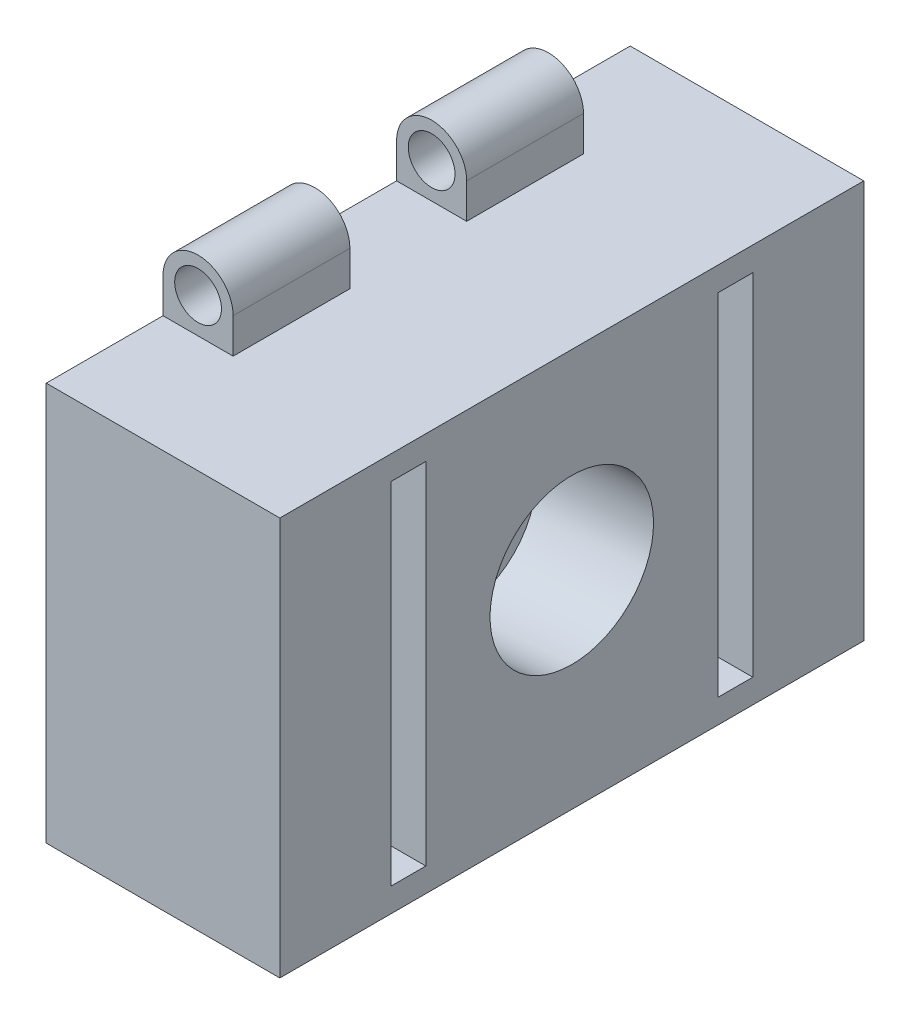
ISO-10303-21;
HEADER;
FILE_DESCRIPTION(('STEP AP214'),'2;1');
FILE_NAME('part.step','',(''),(''),'','','');
FILE_SCHEMA(('AUTOMOTIVE_DESIGN { 1 0 10303 214 1 1 1 1 }'));
ENDSEC;
DATA;
#1=APPLICATION_CONTEXT('core data for automotive mechanical design processes');
#2=APPLICATION_PROTOCOL_DEFINITION('international standard','automotive_design',2000,#1);
#3=PRODUCT_CONTEXT('',#1,'mechanical');
#4=PRODUCT('Part','Part','',(#3));
#5=PRODUCT_RELATED_PRODUCT_CATEGORY('part','',(#4));
#6=PRODUCT_DEFINITION_FORMATION('','',#4);
#7=PRODUCT_DEFINITION_CONTEXT('part definition',#1,'design');
#8=PRODUCT_DEFINITION('design','',#6,#7);
#9=PRODUCT_DEFINITION_SHAPE('','',#8);
#10=(LENGTH_UNIT() NAMED_UNIT(*) SI_UNIT(.MILLI.,.METRE.));
#11=(NAMED_UNIT(*) PLANE_ANGLE_UNIT() SI_UNIT($,.RADIAN.));
#12=(NAMED_UNIT(*) SI_UNIT($,.STERADIAN.) SOLID_ANGLE_UNIT());
#13=UNCERTAINTY_MEASURE_WITH_UNIT(LENGTH_MEASURE(1.E-05),#10,'distance_accuracy_value','');
#14=(GEOMETRIC_REPRESENTATION_CONTEXT(3) GLOBAL_UNCERTAINTY_ASSIGNED_CONTEXT((#13)) GLOBAL_UNIT_ASSIGNED_CONTEXT((#10,
#11,#12)) REPRESENTATION_CONTEXT('',''));
#15=CARTESIAN_POINT('',(0.,0.,0.));
#16=DIRECTION('',(0.,0.,1.));
#17=DIRECTION('',(1.,0.,0.));
#18=AXIS2_PLACEMENT_3D('',#15,#16,#17);
#19=CARTESIAN_POINT('',(20.,0.,0.));
#20=DIRECTION('',(-1.,0.,0.));
#21=DIRECTION('',(0.,0.,1.));
#22=AXIS2_PLACEMENT_3D('',#19,#20,#21);
#23=PLANE('',#22);
#24=DIRECTION('',(0.,0.,-1.));
#25=VECTOR('',#24,1.);
#26=CARTESIAN_POINT('',(20.,2.055,0.));
#27=LINE('',#26,#25);
#28=CARTESIAN_POINT('',(20.,2.055,-9.5));
#29=VERTEX_POINT('',#28);
#30=CARTESIAN_POINT('',(20.,2.055,-12.5));
#31=VERTEX_POINT('',#30);
#32=EDGE_CURVE('E267',#29,#31,#27,.T.);
#33=ORIENTED_EDGE('',*,*,#32,.F.);
#34=DIRECTION('',(0.,-1.,0.));
#35=VECTOR('',#34,1.);
#36=CARTESIAN_POINT('',(20.,0.,-9.5));
#37=LINE('',#36,#35);
#38=CARTESIAN_POINT('',(20.,32.055,-9.5));
#39=VERTEX_POINT('',#38);
#40=EDGE_CURVE('E59',#39,#29,#37,.T.);
#41=ORIENTED_EDGE('',*,*,#40,.F.);
#42=DIRECTION('',(0.,0.,1.));
#43=VECTOR('',#42,1.);
#44=CARTESIAN_POINT('',(20.,32.055,0.));
#45=LINE('',#44,#43);
#46=CARTESIAN_POINT('',(20.,32.055,-12.5));
#47=VERTEX_POINT('',#46);
#48=EDGE_CURVE('E254',#47,#39,#45,.T.);
#49=ORIENTED_EDGE('',*,*,#48,.F.);
#50=DIRECTION('',(0.,1.,0.));
#51=VECTOR('',#50,1.);
#52=CARTESIAN_POINT('',(20.,0.,-12.5));
#53=LINE('',#52,#51);
#54=EDGE_CURVE('E258',#31,#47,#53,.T.);
#55=ORIENTED_EDGE('',*,*,#54,.F.);
#56=EDGE_LOOP('',(#33,#41,#49,#55));
#57=FACE_BOUND('',#56,.T.);
#58=CARTESIAN_POINT('',(20.,17.754268119435,-25.));
#59=DIRECTION('',(-1.,0.,0.));
#60=DIRECTION('',(0.,-1.,0.));
#61=AXIS2_PLACEMENT_3D('',#58,#59,#60);
#62=ELLIPSE('',#61,7.0170932865682,7.);
#63=CARTESIAN_POINT('',(20.,10.7371748328668,-25.));
#64=VERTEX_POINT('',#63);
#65=EDGE_CURVE('E11',#64,#64,#62,.F.);
#66=ORIENTED_EDGE('',*,*,#65,.F.);
#67=EDGE_LOOP('',(#66));
#68=FACE_BOUND('',#67,.T.);
#69=DIRECTION('',(0.,-1.,0.));
#70=VECTOR('',#69,1.);
#71=CARTESIAN_POINT('',(20.,0.,0.));
#72=LINE('',#71,#70);
#73=CARTESIAN_POINT('',(20.,34.11,0.));
#74=VERTEX_POINT('',#73);
#75=CARTESIAN_POINT('',(20.,0.,0.));
#76=VERTEX_POINT('',#75);
#77=EDGE_CURVE('E515',#74,#76,#72,.T.);
#78=ORIENTED_EDGE('',*,*,#77,.T.);
#79=DIRECTION('',(0.,0.,-1.));
#80=VECTOR('',#79,1.);
#81=CARTESIAN_POINT('',(20.,0.,0.));
#82=LINE('',#81,#80);
#83=CARTESIAN_POINT('',(20.,0.,-50.));
#84=VERTEX_POINT('',#83);
#85=EDGE_CURVE('E519',#76,#84,#82,.T.);
#86=ORIENTED_EDGE('',*,*,#85,.T.);
#87=DIRECTION('',(0.,1.,0.));
#88=VECTOR('',#87,1.);
#89=CARTESIAN_POINT('',(20.,0.,-50.));
#90=LINE('',#89,#88);
#91=CARTESIAN_POINT('',(20.,34.11,-50.));
#92=VERTEX_POINT('',#91);
#93=EDGE_CURVE('E523',#84,#92,#90,.T.);
#94=ORIENTED_EDGE('',*,*,#93,.T.);
#95=DIRECTION('',(0.,0.,1.));
#96=VECTOR('',#95,1.);
#97=CARTESIAN_POINT('',(20.,34.11,0.));
#98=LINE('',#97,#96);
#99=EDGE_CURVE('E526',#92,#74,#98,.T.);
#100=ORIENTED_EDGE('',*,*,#99,.T.);
#101=EDGE_LOOP('',(#78,#86,#94,#100));
#102=FACE_BOUND('',#101,.T.);
#103=DIRECTION('',(0.,0.,1.));
#104=VECTOR('',#103,1.);
#105=CARTESIAN_POINT('',(20.,2.055,0.));
#106=LINE('',#105,#104);
#107=CARTESIAN_POINT('',(20.,2.055,-40.5));
#108=VERTEX_POINT('',#107);
#109=CARTESIAN_POINT('',(20.,2.055,-37.5));
#110=VERTEX_POINT('',#109);
#111=EDGE_CURVE('E67',#108,#110,#106,.T.);
#112=ORIENTED_EDGE('',*,*,#111,.T.);
#113=DIRECTION('',(0.,1.,0.));
#114=VECTOR('',#113,1.);
#115=CARTESIAN_POINT('',(20.,0.,-37.5));
#116=LINE('',#115,#114);
#117=CARTESIAN_POINT('',(20.,32.055,-37.5));
#118=VERTEX_POINT('',#117);
#119=EDGE_CURVE('E288',#110,#118,#116,.T.);
#120=ORIENTED_EDGE('',*,*,#119,.T.);
#121=DIRECTION('',(0.,0.,-1.));
#122=VECTOR('',#121,1.);
#123=CARTESIAN_POINT('',(20.,32.055,0.));
#124=LINE('',#123,#122);
#125=CARTESIAN_POINT('',(20.,32.055,-40.5));
#126=VERTEX_POINT('',#125);
#127=EDGE_CURVE('E304',#118,#126,#124,.T.);
#128=ORIENTED_EDGE('',*,*,#127,.T.);
#129=DIRECTION('',(0.,-1.,0.));
#130=VECTOR('',#129,1.);
#131=CARTESIAN_POINT('',(20.,0.,-40.5));
#132=LINE('',#131,#130);
#133=EDGE_CURVE('E300',#126,#108,#132,.T.);
#134=ORIENTED_EDGE('',*,*,#133,.T.);
#135=EDGE_LOOP('',(#112,#120,#128,#134));
#136=FACE_BOUND('',#135,.T.);
#137=ADVANCED_FACE('F43',(#57,#68,#102,#136),#23,.F.);
#138=CARTESIAN_POINT('',(20.,0.,0.));
#139=DIRECTION('',(0.,1.,0.));
#140=DIRECTION('',(0.,0.,1.));
#141=AXIS2_PLACEMENT_3D('',#138,#139,#140);
#142=PLANE('',#141);
#143=DIRECTION('',(1.,0.,0.));
#144=VECTOR('',#143,1.);
#145=CARTESIAN_POINT('',(0.,0.,-40.));
#146=LINE('',#145,#144);
#147=CARTESIAN_POINT('',(0.,0.,-40.));
#148=VERTEX_POINT('',#147);
#149=CARTESIAN_POINT('',(6.,0.,-40.));
#150=VERTEX_POINT('',#149);
#151=EDGE_CURVE('E333',#148,#150,#146,.T.);
#152=ORIENTED_EDGE('',*,*,#151,.F.);
#153=DIRECTION('',(0.,0.,-1.));
#154=VECTOR('',#153,1.);
#155=CARTESIAN_POINT('',(0.,0.,0.));
#156=LINE('',#155,#154);
#157=CARTESIAN_POINT('',(0.,0.,-50.));
#158=VERTEX_POINT('',#157);
#159=EDGE_CURVE('E533',#148,#158,#156,.T.);
#160=ORIENTED_EDGE('',*,*,#159,.T.);
#161=DIRECTION('',(-1.,0.,0.));
#162=VECTOR('',#161,1.);
#163=CARTESIAN_POINT('',(20.,0.,-50.));
#164=LINE('',#163,#162);
#165=EDGE_CURVE('E552',#84,#158,#164,.T.);
#166=ORIENTED_EDGE('',*,*,#165,.F.);
#167=ORIENTED_EDGE('',*,*,#85,.F.);
#168=DIRECTION('',(-1.,0.,0.));
#169=VECTOR('',#168,1.);
#170=CARTESIAN_POINT('',(20.,0.,0.));
#171=LINE('',#170,#169);
#172=CARTESIAN_POINT('',(0.,0.,0.));
#173=VERTEX_POINT('',#172);
#174=EDGE_CURVE('E52',#76,#173,#171,.T.);
#175=ORIENTED_EDGE('',*,*,#174,.T.);
#176=CARTESIAN_POINT('',(0.,0.,-10.));
#177=VERTEX_POINT('',#176);
#178=EDGE_CURVE('E534',#173,#177,#156,.T.);
#179=ORIENTED_EDGE('',*,*,#178,.T.);
#180=DIRECTION('',(1.,0.,0.));
#181=VECTOR('',#180,1.);
#182=CARTESIAN_POINT('',(3.,0.,-10.));
#183=LINE('',#182,#181);
#184=CARTESIAN_POINT('',(6.,0.,-10.));
#185=VERTEX_POINT('',#184);
#186=EDGE_CURVE('E385',#177,#185,#183,.T.);
#187=ORIENTED_EDGE('',*,*,#186,.T.);
#188=DIRECTION('',(0.,0.,1.));
#189=VECTOR('',#188,1.);
#190=CARTESIAN_POINT('',(6.,0.,-20.));
#191=LINE('',#190,#189);
#192=CARTESIAN_POINT('',(6.,0.,-20.));
#193=VERTEX_POINT('',#192);
#194=EDGE_CURVE('E407',#193,#185,#191,.T.);
#195=ORIENTED_EDGE('',*,*,#194,.F.);
#196=DIRECTION('',(1.,0.,0.));
#197=VECTOR('',#196,1.);
#198=CARTESIAN_POINT('',(0.,0.,-20.));
#199=LINE('',#198,#197);
#200=CARTESIAN_POINT('',(0.,0.,-20.));
#201=VERTEX_POINT('',#200);
#202=EDGE_CURVE('E380',#201,#193,#199,.T.);
#203=ORIENTED_EDGE('',*,*,#202,.F.);
#204=CARTESIAN_POINT('',(0.,0.,-30.));
#205=VERTEX_POINT('',#204);
#206=EDGE_CURVE('E538',#201,#205,#156,.T.);
#207=ORIENTED_EDGE('',*,*,#206,.T.);
#208=DIRECTION('',(1.,0.,0.));
#209=VECTOR('',#208,1.);
#210=CARTESIAN_POINT('',(3.,0.,-30.));
#211=LINE('',#210,#209);
#212=CARTESIAN_POINT('',(6.,0.,-30.));
#213=VERTEX_POINT('',#212);
#214=EDGE_CURVE('E338',#205,#213,#211,.T.);
#215=ORIENTED_EDGE('',*,*,#214,.T.);
#216=DIRECTION('',(0.,0.,1.));
#217=VECTOR('',#216,1.);
#218=CARTESIAN_POINT('',(6.,0.,-40.));
#219=LINE('',#218,#217);
#220=EDGE_CURVE('E360',#150,#213,#219,.T.);
#221=ORIENTED_EDGE('',*,*,#220,.F.);
#222=EDGE_LOOP('',(#152,#160,#166,#167,#175,#179,#187,#195,#203,#207,#215,#221));
#223=FACE_BOUND('',#222,.T.);
#224=ADVANCED_FACE('F560',(#223),#142,.F.);
#225=CARTESIAN_POINT('',(20.,34.11,0.));
#226=DIRECTION('',(0.,-1.,0.));
#227=DIRECTION('',(0.,0.,-1.));
#228=AXIS2_PLACEMENT_3D('',#225,#226,#227);
#229=PLANE('',#228);
#230=DIRECTION('',(1.,0.,0.));
#231=VECTOR('',#230,1.);
#232=CARTESIAN_POINT('',(0.,34.11,-40.));
#233=LINE('',#232,#231);
#234=CARTESIAN_POINT('',(0.,34.11,-40.));
#235=VERTEX_POINT('',#234);
#236=CARTESIAN_POINT('',(6.,34.11,-40.));
#237=VERTEX_POINT('',#236);
#238=EDGE_CURVE('E427',#235,#237,#233,.T.);
#239=ORIENTED_EDGE('',*,*,#238,.T.);
#240=DIRECTION('',(0.,0.,1.));
#241=VECTOR('',#240,1.);
#242=CARTESIAN_POINT('',(6.,34.11,-40.));
#243=LINE('',#242,#241);
#244=CARTESIAN_POINT('',(6.,34.11,-30.));
#245=VERTEX_POINT('',#244);
#246=EDGE_CURVE('E443',#237,#245,#243,.T.);
#247=ORIENTED_EDGE('',*,*,#246,.T.);
#248=DIRECTION('',(1.,0.,0.));
#249=VECTOR('',#248,1.);
#250=CARTESIAN_POINT('',(3.,34.11,-30.));
#251=LINE('',#250,#249);
#252=CARTESIAN_POINT('',(0.,34.11,-30.));
#253=VERTEX_POINT('',#252);
#254=EDGE_CURVE('E423',#253,#245,#251,.T.);
#255=ORIENTED_EDGE('',*,*,#254,.F.);
#256=DIRECTION('',(0.,0.,1.));
#257=VECTOR('',#256,1.);
#258=CARTESIAN_POINT('',(0.,34.11,0.));
#259=LINE('',#258,#257);
#260=CARTESIAN_POINT('',(0.,34.11,-20.));
#261=VERTEX_POINT('',#260);
#262=EDGE_CURVE('E544',#253,#261,#259,.T.);
#263=ORIENTED_EDGE('',*,*,#262,.T.);
#264=DIRECTION('',(1.,0.,0.));
#265=VECTOR('',#264,1.);
#266=CARTESIAN_POINT('',(0.,34.11,-20.));
#267=LINE('',#266,#265);
#268=CARTESIAN_POINT('',(6.,34.11,-20.));
#269=VERTEX_POINT('',#268);
#270=EDGE_CURVE('E475',#261,#269,#267,.T.);
#271=ORIENTED_EDGE('',*,*,#270,.T.);
#272=DIRECTION('',(0.,0.,1.));
#273=VECTOR('',#272,1.);
#274=CARTESIAN_POINT('',(6.,34.11,-20.));
#275=LINE('',#274,#273);
#276=CARTESIAN_POINT('',(6.,34.11,-10.));
#277=VERTEX_POINT('',#276);
#278=EDGE_CURVE('E492',#269,#277,#275,.T.);
#279=ORIENTED_EDGE('',*,*,#278,.T.);
#280=DIRECTION('',(1.,0.,0.));
#281=VECTOR('',#280,1.);
#282=CARTESIAN_POINT('',(3.,34.11,-10.));
#283=LINE('',#282,#281);
#284=CARTESIAN_POINT('',(0.,34.11,-10.));
#285=VERTEX_POINT('',#284);
#286=EDGE_CURVE('E471',#285,#277,#283,.T.);
#287=ORIENTED_EDGE('',*,*,#286,.F.);
#288=CARTESIAN_POINT('',(0.,34.11,0.));
#289=VERTEX_POINT('',#288);
#290=EDGE_CURVE('E541',#285,#289,#259,.T.);
#291=ORIENTED_EDGE('',*,*,#290,.T.);
#292=DIRECTION('',(-1.,0.,0.));
#293=VECTOR('',#292,1.);
#294=CARTESIAN_POINT('',(20.,34.11,0.));
#295=LINE('',#294,#293);
#296=EDGE_CURVE('E529',#74,#289,#295,.T.);
#297=ORIENTED_EDGE('',*,*,#296,.F.);
#298=ORIENTED_EDGE('',*,*,#99,.F.);
#299=DIRECTION('',(-1.,0.,0.));
#300=VECTOR('',#299,1.);
#301=CARTESIAN_POINT('',(20.,34.11,-50.));
#302=LINE('',#301,#300);
#303=CARTESIAN_POINT('',(0.,34.11,-50.));
#304=VERTEX_POINT('',#303);
#305=EDGE_CURVE('E548',#92,#304,#302,.T.);
#306=ORIENTED_EDGE('',*,*,#305,.T.);
#307=EDGE_CURVE('E520',#304,#235,#259,.T.);
#308=ORIENTED_EDGE('',*,*,#307,.T.);
#309=EDGE_LOOP('',(#239,#247,#255,#263,#271,#279,#287,#291,#297,#298,#306,#308));
#310=FACE_BOUND('',#309,.T.);
#311=ADVANCED_FACE('F602',(#310),#229,.F.);
#312=CARTESIAN_POINT('',(20.,0.,0.));
#313=DIRECTION('',(0.,0.,-1.));
#314=DIRECTION('',(-1.,0.,0.));
#315=AXIS2_PLACEMENT_3D('',#312,#313,#314);
#316=PLANE('',#315);
#317=DIRECTION('',(0.,-1.,0.));
#318=VECTOR('',#317,1.);
#319=CARTESIAN_POINT('',(0.,0.,0.));
#320=LINE('',#319,#318);
#321=EDGE_CURVE('E508',#289,#173,#320,.T.);
#322=ORIENTED_EDGE('',*,*,#321,.T.);
#323=ORIENTED_EDGE('',*,*,#174,.F.);
#324=ORIENTED_EDGE('',*,*,#77,.F.);
#325=ORIENTED_EDGE('',*,*,#296,.T.);
#326=EDGE_LOOP('',(#322,#323,#324,#325));
#327=FACE_BOUND('',#326,.T.);
#328=ADVANCED_FACE('F45',(#327),#316,.F.);
#329=CARTESIAN_POINT('',(20.,0.,-50.));
#330=DIRECTION('',(0.,0.,1.));
#331=DIRECTION('',(1.,0.,0.));
#332=AXIS2_PLACEMENT_3D('',#329,#330,#331);
#333=PLANE('',#332);
#334=DIRECTION('',(0.,1.,0.));
#335=VECTOR('',#334,1.);
#336=CARTESIAN_POINT('',(0.,0.,-50.));
#337=LINE('',#336,#335);
#338=EDGE_CURVE('E537',#158,#304,#337,.T.);
#339=ORIENTED_EDGE('',*,*,#338,.T.);
#340=ORIENTED_EDGE('',*,*,#305,.F.);
#341=ORIENTED_EDGE('',*,*,#93,.F.);
#342=ORIENTED_EDGE('',*,*,#165,.T.);
#343=EDGE_LOOP('',(#339,#340,#341,#342));
#344=FACE_BOUND('',#343,.T.);
#345=ADVANCED_FACE('F596',(#344),#333,.F.);
#346=CARTESIAN_POINT('',(0.,0.,0.));
#347=DIRECTION('',(-1.,0.,0.));
#348=DIRECTION('',(0.,0.,1.));
#349=AXIS2_PLACEMENT_3D('',#346,#347,#348);
#350=PLANE('',#349);
#351=ORIENTED_EDGE('',*,*,#321,.F.);
#352=ORIENTED_EDGE('',*,*,#290,.F.);
#353=DIRECTION('',(0.,-1.,0.));
#354=VECTOR('',#353,1.);
#355=CARTESIAN_POINT('',(0.,34.11,-10.));
#356=LINE('',#355,#354);
#357=CARTESIAN_POINT('',(0.,37.11,-10.));
#358=VERTEX_POINT('',#357);
#359=EDGE_CURVE('E480',#358,#285,#356,.T.);
#360=ORIENTED_EDGE('',*,*,#359,.F.);
#361=DIRECTION('',(0.,0.,1.));
#362=VECTOR('',#361,1.);
#363=CARTESIAN_POINT('',(0.,37.11,-20.));
#364=LINE('',#363,#362);
#365=CARTESIAN_POINT('',(0.,37.11,-20.));
#366=VERTEX_POINT('',#365);
#367=EDGE_CURVE('E505',#366,#358,#364,.T.);
#368=ORIENTED_EDGE('',*,*,#367,.F.);
#369=DIRECTION('',(0.,-1.,0.));
#370=VECTOR('',#369,1.);
#371=CARTESIAN_POINT('',(0.,34.11,-20.));
#372=LINE('',#371,#370);
#373=EDGE_CURVE('E488',#366,#261,#372,.T.);
#374=ORIENTED_EDGE('',*,*,#373,.T.);
#375=ORIENTED_EDGE('',*,*,#262,.F.);
#376=DIRECTION('',(0.,-1.,0.));
#377=VECTOR('',#376,1.);
#378=CARTESIAN_POINT('',(0.,34.11,-30.));
#379=LINE('',#378,#377);
#380=CARTESIAN_POINT('',(0.,37.11,-30.));
#381=VERTEX_POINT('',#380);
#382=EDGE_CURVE('E431',#381,#253,#379,.T.);
#383=ORIENTED_EDGE('',*,*,#382,.F.);
#384=DIRECTION('',(0.,0.,1.));
#385=VECTOR('',#384,1.);
#386=CARTESIAN_POINT('',(0.,37.11,-40.));
#387=LINE('',#386,#385);
#388=CARTESIAN_POINT('',(0.,37.11,-40.));
#389=VERTEX_POINT('',#388);
#390=EDGE_CURVE('E458',#389,#381,#387,.T.);
#391=ORIENTED_EDGE('',*,*,#390,.F.);
#392=DIRECTION('',(0.,-1.,0.));
#393=VECTOR('',#392,1.);
#394=CARTESIAN_POINT('',(0.,34.11,-40.));
#395=LINE('',#394,#393);
#396=EDGE_CURVE('E439',#389,#235,#395,.T.);
#397=ORIENTED_EDGE('',*,*,#396,.T.);
#398=ORIENTED_EDGE('',*,*,#307,.F.);
#399=ORIENTED_EDGE('',*,*,#338,.F.);
#400=ORIENTED_EDGE('',*,*,#159,.F.);
#401=DIRECTION('',(0.,1.,0.));
#402=VECTOR('',#401,1.);
#403=CARTESIAN_POINT('',(0.,0.,-40.));
#404=LINE('',#403,#402);
#405=CARTESIAN_POINT('',(0.,-3.,-40.));
#406=VERTEX_POINT('',#405);
#407=EDGE_CURVE('E337',#406,#148,#404,.T.);
#408=ORIENTED_EDGE('',*,*,#407,.F.);
#409=DIRECTION('',(0.,0.,1.));
#410=VECTOR('',#409,1.);
#411=CARTESIAN_POINT('',(0.,-3.,-40.));
#412=LINE('',#411,#410);
#413=CARTESIAN_POINT('',(0.,-3.,-30.));
#414=VERTEX_POINT('',#413);
#415=EDGE_CURVE('E348',#406,#414,#412,.T.);
#416=ORIENTED_EDGE('',*,*,#415,.T.);
#417=DIRECTION('',(0.,1.,0.));
#418=VECTOR('',#417,1.);
#419=CARTESIAN_POINT('',(0.,0.,-30.));
#420=LINE('',#419,#418);
#421=EDGE_CURVE('E329',#414,#205,#420,.T.);
#422=ORIENTED_EDGE('',*,*,#421,.T.);
#423=ORIENTED_EDGE('',*,*,#206,.F.);
#424=DIRECTION('',(0.,1.,0.));
#425=VECTOR('',#424,1.);
#426=CARTESIAN_POINT('',(0.,0.,-20.));
#427=LINE('',#426,#425);
#428=CARTESIAN_POINT('',(0.,-3.,-20.));
#429=VERTEX_POINT('',#428);
#430=EDGE_CURVE('E384',#429,#201,#427,.T.);
#431=ORIENTED_EDGE('',*,*,#430,.F.);
#432=DIRECTION('',(0.,0.,1.));
#433=VECTOR('',#432,1.);
#434=CARTESIAN_POINT('',(0.,-3.,-20.));
#435=LINE('',#434,#433);
#436=CARTESIAN_POINT('',(0.,-3.,-10.));
#437=VERTEX_POINT('',#436);
#438=EDGE_CURVE('E395',#429,#437,#435,.T.);
#439=ORIENTED_EDGE('',*,*,#438,.T.);
#440=DIRECTION('',(0.,1.,0.));
#441=VECTOR('',#440,1.);
#442=CARTESIAN_POINT('',(0.,0.,-10.));
#443=LINE('',#442,#441);
#444=EDGE_CURVE('E376',#437,#177,#443,.T.);
#445=ORIENTED_EDGE('',*,*,#444,.T.);
#446=ORIENTED_EDGE('',*,*,#178,.F.);
#447=EDGE_LOOP('',(#351,#352,#360,#368,#374,#375,#383,#391,#397,#398,#399,#400,#408,#416,#422,
#423,#431,#439,#445,#446));
#448=FACE_BOUND('',#447,.T.);
#449=ADVANCED_FACE('F569',(#448),#350,.T.);
#450=CARTESIAN_POINT('',(3.,37.11,-20.));
#451=DIRECTION('',(0.,0.,1.));
#452=DIRECTION('',(1.,0.,0.));
#453=AXIS2_PLACEMENT_3D('',#450,#451,#452);
#454=CYLINDRICAL_SURFACE('',#453,3.);
#455=CARTESIAN_POINT('',(3.,37.11,-10.));
#456=DIRECTION('',(0.,0.,1.));
#457=DIRECTION('',(1.,0.,0.));
#458=AXIS2_PLACEMENT_3D('',#455,#456,#457);
#459=CIRCLE('',#458,3.);
#460=CARTESIAN_POINT('',(6.,37.11,-10.));
#461=VERTEX_POINT('',#460);
#462=EDGE_CURVE('E499',#461,#358,#459,.T.);
#463=ORIENTED_EDGE('',*,*,#462,.F.);
#464=DIRECTION('',(0.,0.,1.));
#465=VECTOR('',#464,1.);
#466=CARTESIAN_POINT('',(6.,37.11,-20.));
#467=LINE('',#466,#465);
#468=CARTESIAN_POINT('',(6.,37.11,-20.));
#469=VERTEX_POINT('',#468);
#470=EDGE_CURVE('E509',#469,#461,#467,.T.);
#471=ORIENTED_EDGE('',*,*,#470,.F.);
#472=CARTESIAN_POINT('',(3.,37.11,-20.));
#473=DIRECTION('',(0.,0.,1.));
#474=DIRECTION('',(1.,0.,0.));
#475=AXIS2_PLACEMENT_3D('',#472,#473,#474);
#476=CIRCLE('',#475,3.);
#477=EDGE_CURVE('E484',#469,#366,#476,.T.);
#478=ORIENTED_EDGE('',*,*,#477,.T.);
#479=ORIENTED_EDGE('',*,*,#367,.T.);
#480=EDGE_LOOP('',(#463,#471,#478,#479));
#481=FACE_BOUND('',#480,.T.);
#482=ADVANCED_FACE('F631',(#481),#454,.T.);
#483=CARTESIAN_POINT('',(6.,34.11,-20.));
#484=DIRECTION('',(1.,0.,0.));
#485=DIRECTION('',(0.,0.,-1.));
#486=AXIS2_PLACEMENT_3D('',#483,#484,#485);
#487=PLANE('',#486);
#488=DIRECTION('',(0.,1.,0.));
#489=VECTOR('',#488,1.);
#490=CARTESIAN_POINT('',(6.,34.11,-10.));
#491=LINE('',#490,#489);
#492=EDGE_CURVE('E495',#277,#461,#491,.T.);
#493=ORIENTED_EDGE('',*,*,#492,.F.);
#494=ORIENTED_EDGE('',*,*,#278,.F.);
#495=DIRECTION('',(0.,1.,0.));
#496=VECTOR('',#495,1.);
#497=CARTESIAN_POINT('',(6.,34.11,-20.));
#498=LINE('',#497,#496);
#499=EDGE_CURVE('E479',#269,#469,#498,.T.);
#500=ORIENTED_EDGE('',*,*,#499,.T.);
#501=ORIENTED_EDGE('',*,*,#470,.T.);
#502=EDGE_LOOP('',(#493,#494,#500,#501));
#503=FACE_BOUND('',#502,.T.);
#504=ADVANCED_FACE('F626',(#503),#487,.T.);
#505=CARTESIAN_POINT('',(3.,37.11,-20.));
#506=DIRECTION('',(0.,0.,1.));
#507=DIRECTION('',(1.,0.,0.));
#508=AXIS2_PLACEMENT_3D('',#505,#506,#507);
#509=PLANE('',#508);
#510=CARTESIAN_POINT('',(3.,37.11,-20.));
#511=DIRECTION('',(0.,0.,1.));
#512=DIRECTION('',(1.,0.,0.));
#513=AXIS2_PLACEMENT_3D('',#510,#511,#512);
#514=CIRCLE('',#513,2.);
#515=CARTESIAN_POINT('',(5.,37.11,-20.));
#516=VERTEX_POINT('',#515);
#517=EDGE_CURVE('E467',#516,#516,#514,.T.);
#518=ORIENTED_EDGE('',*,*,#517,.T.);
#519=EDGE_LOOP('',(#518));
#520=FACE_BOUND('',#519,.T.);
#521=ORIENTED_EDGE('',*,*,#270,.F.);
#522=ORIENTED_EDGE('',*,*,#373,.F.);
#523=ORIENTED_EDGE('',*,*,#477,.F.);
#524=ORIENTED_EDGE('',*,*,#499,.F.);
#525=EDGE_LOOP('',(#521,#522,#523,#524));
#526=FACE_BOUND('',#525,.T.);
#527=ADVANCED_FACE('F633',(#520,#526),#509,.F.);
#528=CARTESIAN_POINT('',(3.,37.11,-10.));
#529=DIRECTION('',(0.,0.,1.));
#530=DIRECTION('',(1.,0.,0.));
#531=AXIS2_PLACEMENT_3D('',#528,#529,#530);
#532=PLANE('',#531);
#533=CARTESIAN_POINT('',(3.,37.11,-10.));
#534=DIRECTION('',(0.,0.,1.));
#535=DIRECTION('',(1.,0.,0.));
#536=AXIS2_PLACEMENT_3D('',#533,#534,#535);
#537=CIRCLE('',#536,2.);
#538=CARTESIAN_POINT('',(5.,37.11,-10.));
#539=VERTEX_POINT('',#538);
#540=EDGE_CURVE('E461',#539,#539,#537,.T.);
#541=ORIENTED_EDGE('',*,*,#540,.F.);
#542=EDGE_LOOP('',(#541));
#543=FACE_BOUND('',#542,.T.);
#544=ORIENTED_EDGE('',*,*,#359,.T.);
#545=ORIENTED_EDGE('',*,*,#286,.T.);
#546=ORIENTED_EDGE('',*,*,#492,.T.);
#547=ORIENTED_EDGE('',*,*,#462,.T.);
#548=EDGE_LOOP('',(#544,#545,#546,#547));
#549=FACE_BOUND('',#548,.T.);
#550=ADVANCED_FACE('F624',(#543,#549),#532,.T.);
#551=CARTESIAN_POINT('',(3.,37.11,-20.));
#552=DIRECTION('',(0.,0.,1.));
#553=DIRECTION('',(1.,0.,0.));
#554=AXIS2_PLACEMENT_3D('',#551,#552,#553);
#555=CYLINDRICAL_SURFACE('',#554,2.);
#556=ORIENTED_EDGE('',*,*,#517,.F.);
#557=EDGE_LOOP('',(#556));
#558=FACE_BOUND('',#557,.T.);
#559=ORIENTED_EDGE('',*,*,#540,.T.);
#560=EDGE_LOOP('',(#559));
#561=FACE_BOUND('',#560,.T.);
#562=ADVANCED_FACE('F641',(#558,#561),#555,.F.);
#563=CARTESIAN_POINT('',(3.,37.11,-40.));
#564=DIRECTION('',(0.,0.,1.));
#565=DIRECTION('',(1.,0.,0.));
#566=AXIS2_PLACEMENT_3D('',#563,#564,#565);
#567=CYLINDRICAL_SURFACE('',#566,3.);
#568=CARTESIAN_POINT('',(3.,37.11,-30.));
#569=DIRECTION('',(0.,0.,1.));
#570=DIRECTION('',(1.,0.,0.));
#571=AXIS2_PLACEMENT_3D('',#568,#569,#570);
#572=CIRCLE('',#571,3.);
#573=CARTESIAN_POINT('',(6.,37.11,-30.));
#574=VERTEX_POINT('',#573);
#575=EDGE_CURVE('E451',#574,#381,#572,.T.);
#576=ORIENTED_EDGE('',*,*,#575,.F.);
#577=DIRECTION('',(0.,0.,1.));
#578=VECTOR('',#577,1.);
#579=CARTESIAN_POINT('',(6.,37.11,-40.));
#580=LINE('',#579,#578);
#581=CARTESIAN_POINT('',(6.,37.11,-40.));
#582=VERTEX_POINT('',#581);
#583=EDGE_CURVE('E462',#582,#574,#580,.T.);
#584=ORIENTED_EDGE('',*,*,#583,.F.);
#585=CARTESIAN_POINT('',(3.,37.11,-40.));
#586=DIRECTION('',(0.,0.,1.));
#587=DIRECTION('',(1.,0.,0.));
#588=AXIS2_PLACEMENT_3D('',#585,#586,#587);
#589=CIRCLE('',#588,3.);
#590=EDGE_CURVE('E435',#582,#389,#589,.T.);
#591=ORIENTED_EDGE('',*,*,#590,.T.);
#592=ORIENTED_EDGE('',*,*,#390,.T.);
#593=EDGE_LOOP('',(#576,#584,#591,#592));
#594=FACE_BOUND('',#593,.T.);
#595=ADVANCED_FACE('F711',(#594),#567,.T.);
#596=CARTESIAN_POINT('',(6.,34.11,-40.));
#597=DIRECTION('',(1.,0.,0.));
#598=DIRECTION('',(0.,0.,-1.));
#599=AXIS2_PLACEMENT_3D('',#596,#597,#598);
#600=PLANE('',#599);
#601=DIRECTION('',(0.,1.,0.));
#602=VECTOR('',#601,1.);
#603=CARTESIAN_POINT('',(6.,34.11,-30.));
#604=LINE('',#603,#602);
#605=EDGE_CURVE('E447',#245,#574,#604,.T.);
#606=ORIENTED_EDGE('',*,*,#605,.F.);
#607=ORIENTED_EDGE('',*,*,#246,.F.);
#608=DIRECTION('',(0.,1.,0.));
#609=VECTOR('',#608,1.);
#610=CARTESIAN_POINT('',(6.,34.11,-40.));
#611=LINE('',#610,#609);
#612=EDGE_CURVE('E430',#237,#582,#611,.T.);
#613=ORIENTED_EDGE('',*,*,#612,.T.);
#614=ORIENTED_EDGE('',*,*,#583,.T.);
#615=EDGE_LOOP('',(#606,#607,#613,#614));
#616=FACE_BOUND('',#615,.T.);
#617=ADVANCED_FACE('F611',(#616),#600,.T.);
#618=CARTESIAN_POINT('',(3.,37.11,-40.));
#619=DIRECTION('',(0.,0.,1.));
#620=DIRECTION('',(1.,0.,0.));
#621=AXIS2_PLACEMENT_3D('',#618,#619,#620);
#622=PLANE('',#621);
#623=CARTESIAN_POINT('',(3.,37.11,-40.));
#624=DIRECTION('',(0.,0.,1.));
#625=DIRECTION('',(1.,0.,0.));
#626=AXIS2_PLACEMENT_3D('',#623,#624,#625);
#627=CIRCLE('',#626,2.);
#628=CARTESIAN_POINT('',(5.,37.11,-40.));
#629=VERTEX_POINT('',#628);
#630=EDGE_CURVE('E419',#629,#629,#627,.T.);
#631=ORIENTED_EDGE('',*,*,#630,.T.);
#632=EDGE_LOOP('',(#631));
#633=FACE_BOUND('',#632,.T.);
#634=ORIENTED_EDGE('',*,*,#238,.F.);
#635=ORIENTED_EDGE('',*,*,#396,.F.);
#636=ORIENTED_EDGE('',*,*,#590,.F.);
#637=ORIENTED_EDGE('',*,*,#612,.F.);
#638=EDGE_LOOP('',(#634,#635,#636,#637));
#639=FACE_BOUND('',#638,.T.);
#640=ADVANCED_FACE('F607',(#633,#639),#622,.F.);
#641=CARTESIAN_POINT('',(3.,37.11,-30.));
#642=DIRECTION('',(0.,0.,1.));
#643=DIRECTION('',(1.,0.,0.));
#644=AXIS2_PLACEMENT_3D('',#641,#642,#643);
#645=PLANE('',#644);
#646=CARTESIAN_POINT('',(3.,37.11,-30.));
#647=DIRECTION('',(0.,0.,1.));
#648=DIRECTION('',(1.,0.,0.));
#649=AXIS2_PLACEMENT_3D('',#646,#647,#648);
#650=CIRCLE('',#649,2.);
#651=CARTESIAN_POINT('',(5.,37.11,-30.));
#652=VERTEX_POINT('',#651);
#653=EDGE_CURVE('E411',#652,#652,#650,.T.);
#654=ORIENTED_EDGE('',*,*,#653,.F.);
#655=EDGE_LOOP('',(#654));
#656=FACE_BOUND('',#655,.T.);
#657=ORIENTED_EDGE('',*,*,#382,.T.);
#658=ORIENTED_EDGE('',*,*,#254,.T.);
#659=ORIENTED_EDGE('',*,*,#605,.T.);
#660=ORIENTED_EDGE('',*,*,#575,.T.);
#661=EDGE_LOOP('',(#657,#658,#659,#660));
#662=FACE_BOUND('',#661,.T.);
#663=ADVANCED_FACE('F617',(#656,#662),#645,.T.);
#664=CARTESIAN_POINT('',(3.,37.11,-40.));
#665=DIRECTION('',(0.,0.,1.));
#666=DIRECTION('',(1.,0.,0.));
#667=AXIS2_PLACEMENT_3D('',#664,#665,#666);
#668=CYLINDRICAL_SURFACE('',#667,2.);
#669=ORIENTED_EDGE('',*,*,#630,.F.);
#670=EDGE_LOOP('',(#669));
#671=FACE_BOUND('',#670,.T.);
#672=ORIENTED_EDGE('',*,*,#653,.T.);
#673=EDGE_LOOP('',(#672));
#674=FACE_BOUND('',#673,.T.);
#675=ADVANCED_FACE('F756',(#671,#674),#668,.F.);
#676=CARTESIAN_POINT('',(3.,-3.,-20.));
#677=DIRECTION('',(0.,0.,1.));
#678=DIRECTION('',(1.,0.,0.));
#679=AXIS2_PLACEMENT_3D('',#676,#677,#678);
#680=PLANE('',#679);
#681=ORIENTED_EDGE('',*,*,#202,.T.);
#682=DIRECTION('',(0.,-1.,0.));
#683=VECTOR('',#682,1.);
#684=CARTESIAN_POINT('',(6.,0.,-20.));
#685=LINE('',#684,#683);
#686=CARTESIAN_POINT('',(6.,-3.,-20.));
#687=VERTEX_POINT('',#686);
#688=EDGE_CURVE('E392',#193,#687,#685,.T.);
#689=ORIENTED_EDGE('',*,*,#688,.T.);
#690=CARTESIAN_POINT('',(3.,-3.,-20.));
#691=DIRECTION('',(0.,0.,-1.));
#692=DIRECTION('',(1.,0.,0.));
#693=AXIS2_PLACEMENT_3D('',#690,#691,#692);
#694=CIRCLE('',#693,3.);
#695=EDGE_CURVE('E389',#687,#429,#694,.T.);
#696=ORIENTED_EDGE('',*,*,#695,.T.);
#697=ORIENTED_EDGE('',*,*,#430,.T.);
#698=EDGE_LOOP('',(#681,#689,#696,#697));
#699=FACE_BOUND('',#698,.T.);
#700=CARTESIAN_POINT('',(3.,-3.,-20.));
#701=DIRECTION('',(0.,0.,-1.));
#702=DIRECTION('',(1.,0.,0.));
#703=AXIS2_PLACEMENT_3D('',#700,#701,#702);
#704=CIRCLE('',#703,2.);
#705=CARTESIAN_POINT('',(5.,-3.,-20.));
#706=VERTEX_POINT('',#705);
#707=EDGE_CURVE('E372',#706,#706,#704,.T.);
#708=ORIENTED_EDGE('',*,*,#707,.F.);
#709=EDGE_LOOP('',(#708));
#710=FACE_BOUND('',#709,.T.);
#711=ADVANCED_FACE('F585',(#699,#710),#680,.F.);
#712=CARTESIAN_POINT('',(3.,-3.,-10.));
#713=DIRECTION('',(0.,0.,1.));
#714=DIRECTION('',(1.,0.,0.));
#715=AXIS2_PLACEMENT_3D('',#712,#713,#714);
#716=PLANE('',#715);
#717=ORIENTED_EDGE('',*,*,#186,.F.);
#718=ORIENTED_EDGE('',*,*,#444,.F.);
#719=CARTESIAN_POINT('',(3.,-3.,-10.));
#720=DIRECTION('',(0.,0.,-1.));
#721=DIRECTION('',(1.,0.,0.));
#722=AXIS2_PLACEMENT_3D('',#719,#720,#721);
#723=CIRCLE('',#722,3.);
#724=CARTESIAN_POINT('',(6.,-3.,-10.));
#725=VERTEX_POINT('',#724);
#726=EDGE_CURVE('E399',#725,#437,#723,.T.);
#727=ORIENTED_EDGE('',*,*,#726,.F.);
#728=DIRECTION('',(0.,-1.,0.));
#729=VECTOR('',#728,1.);
#730=CARTESIAN_POINT('',(6.,0.,-10.));
#731=LINE('',#730,#729);
#732=EDGE_CURVE('E402',#185,#725,#731,.T.);
#733=ORIENTED_EDGE('',*,*,#732,.F.);
#734=EDGE_LOOP('',(#717,#718,#727,#733));
#735=FACE_BOUND('',#734,.T.);
#736=CARTESIAN_POINT('',(3.,-3.,-10.));
#737=DIRECTION('',(0.,0.,-1.));
#738=DIRECTION('',(1.,0.,0.));
#739=AXIS2_PLACEMENT_3D('',#736,#737,#738);
#740=CIRCLE('',#739,2.);
#741=CARTESIAN_POINT('',(5.,-3.,-10.));
#742=VERTEX_POINT('',#741);
#743=EDGE_CURVE('E364',#742,#742,#740,.T.);
#744=ORIENTED_EDGE('',*,*,#743,.T.);
#745=EDGE_LOOP('',(#744));
#746=FACE_BOUND('',#745,.T.);
#747=ADVANCED_FACE('F576',(#735,#746),#716,.T.);
#748=CARTESIAN_POINT('',(6.,0.,-20.));
#749=DIRECTION('',(-1.,0.,0.));
#750=DIRECTION('',(0.,0.,1.));
#751=AXIS2_PLACEMENT_3D('',#748,#749,#750);
#752=PLANE('',#751);
#753=ORIENTED_EDGE('',*,*,#732,.T.);
#754=DIRECTION('',(0.,0.,1.));
#755=VECTOR('',#754,1.);
#756=CARTESIAN_POINT('',(6.,-3.,-20.));
#757=LINE('',#756,#755);
#758=EDGE_CURVE('E412',#687,#725,#757,.T.);
#759=ORIENTED_EDGE('',*,*,#758,.F.);
#760=ORIENTED_EDGE('',*,*,#688,.F.);
#761=ORIENTED_EDGE('',*,*,#194,.T.);
#762=EDGE_LOOP('',(#753,#759,#760,#761));
#763=FACE_BOUND('',#762,.T.);
#764=ADVANCED_FACE('F581',(#763),#752,.F.);
#765=CARTESIAN_POINT('',(3.,-3.,-20.));
#766=DIRECTION('',(0.,0.,1.));
#767=DIRECTION('',(1.,0.,0.));
#768=AXIS2_PLACEMENT_3D('',#765,#766,#767);
#769=CYLINDRICAL_SURFACE('',#768,3.);
#770=ORIENTED_EDGE('',*,*,#726,.T.);
#771=ORIENTED_EDGE('',*,*,#438,.F.);
#772=ORIENTED_EDGE('',*,*,#695,.F.);
#773=ORIENTED_EDGE('',*,*,#758,.T.);
#774=EDGE_LOOP('',(#770,#771,#772,#773));
#775=FACE_BOUND('',#774,.T.);
#776=ADVANCED_FACE('F810',(#775),#769,.T.);
#777=CARTESIAN_POINT('',(3.,-3.,-20.));
#778=DIRECTION('',(0.,0.,1.));
#779=DIRECTION('',(1.,0.,0.));
#780=AXIS2_PLACEMENT_3D('',#777,#778,#779);
#781=CYLINDRICAL_SURFACE('',#780,2.);
#782=ORIENTED_EDGE('',*,*,#707,.T.);
#783=EDGE_LOOP('',(#782));
#784=FACE_BOUND('',#783,.T.);
#785=ORIENTED_EDGE('',*,*,#743,.F.);
#786=EDGE_LOOP('',(#785));
#787=FACE_BOUND('',#786,.T.);
#788=ADVANCED_FACE('F820',(#784,#787),#781,.F.);
#789=CARTESIAN_POINT('',(3.,-3.,-40.));
#790=DIRECTION('',(0.,0.,1.));
#791=DIRECTION('',(1.,0.,0.));
#792=AXIS2_PLACEMENT_3D('',#789,#790,#791);
#793=PLANE('',#792);
#794=ORIENTED_EDGE('',*,*,#151,.T.);
#795=DIRECTION('',(0.,-1.,0.));
#796=VECTOR('',#795,1.);
#797=CARTESIAN_POINT('',(6.,0.,-40.));
#798=LINE('',#797,#796);
#799=CARTESIAN_POINT('',(6.,-3.,-40.));
#800=VERTEX_POINT('',#799);
#801=EDGE_CURVE('E345',#150,#800,#798,.T.);
#802=ORIENTED_EDGE('',*,*,#801,.T.);
#803=CARTESIAN_POINT('',(3.,-3.,-40.));
#804=DIRECTION('',(0.,0.,-1.));
#805=DIRECTION('',(1.,0.,0.));
#806=AXIS2_PLACEMENT_3D('',#803,#804,#805);
#807=CIRCLE('',#806,3.);
#808=EDGE_CURVE('E342',#800,#406,#807,.T.);
#809=ORIENTED_EDGE('',*,*,#808,.T.);
#810=ORIENTED_EDGE('',*,*,#407,.T.);
#811=EDGE_LOOP('',(#794,#802,#809,#810));
#812=FACE_BOUND('',#811,.T.);
#813=CARTESIAN_POINT('',(3.,-3.,-40.));
#814=DIRECTION('',(0.,0.,-1.));
#815=DIRECTION('',(1.,0.,0.));
#816=AXIS2_PLACEMENT_3D('',#813,#814,#815);
#817=CIRCLE('',#816,2.);
#818=CARTESIAN_POINT('',(5.,-3.,-40.));
#819=VERTEX_POINT('',#818);
#820=EDGE_CURVE('E325',#819,#819,#817,.T.);
#821=ORIENTED_EDGE('',*,*,#820,.F.);
#822=EDGE_LOOP('',(#821));
#823=FACE_BOUND('',#822,.T.);
#824=ADVANCED_FACE('F831',(#812,#823),#793,.F.);
#825=CARTESIAN_POINT('',(3.,-3.,-30.));
#826=DIRECTION('',(0.,0.,1.));
#827=DIRECTION('',(1.,0.,0.));
#828=AXIS2_PLACEMENT_3D('',#825,#826,#827);
#829=PLANE('',#828);
#830=ORIENTED_EDGE('',*,*,#214,.F.);
#831=ORIENTED_EDGE('',*,*,#421,.F.);
#832=CARTESIAN_POINT('',(3.,-3.,-30.));
#833=DIRECTION('',(0.,0.,-1.));
#834=DIRECTION('',(1.,0.,0.));
#835=AXIS2_PLACEMENT_3D('',#832,#833,#834);
#836=CIRCLE('',#835,3.);
#837=CARTESIAN_POINT('',(6.,-3.,-30.));
#838=VERTEX_POINT('',#837);
#839=EDGE_CURVE('E352',#838,#414,#836,.T.);
#840=ORIENTED_EDGE('',*,*,#839,.F.);
#841=DIRECTION('',(0.,-1.,0.));
#842=VECTOR('',#841,1.);
#843=CARTESIAN_POINT('',(6.,0.,-30.));
#844=LINE('',#843,#842);
#845=EDGE_CURVE('E355',#213,#838,#844,.T.);
#846=ORIENTED_EDGE('',*,*,#845,.F.);
#847=EDGE_LOOP('',(#830,#831,#840,#846));
#848=FACE_BOUND('',#847,.T.);
#849=CARTESIAN_POINT('',(3.,-3.,-30.));
#850=DIRECTION('',(0.,0.,-1.));
#851=DIRECTION('',(1.,0.,0.));
#852=AXIS2_PLACEMENT_3D('',#849,#850,#851);
#853=CIRCLE('',#852,2.);
#854=CARTESIAN_POINT('',(5.,-3.,-30.));
#855=VERTEX_POINT('',#854);
#856=EDGE_CURVE('E324',#855,#855,#853,.T.);
#857=ORIENTED_EDGE('',*,*,#856,.T.);
#858=EDGE_LOOP('',(#857));
#859=FACE_BOUND('',#858,.T.);
#860=ADVANCED_FACE('F840',(#848,#859),#829,.T.);
#861=CARTESIAN_POINT('',(6.,0.,-40.));
#862=DIRECTION('',(-1.,0.,0.));
#863=DIRECTION('',(0.,0.,1.));
#864=AXIS2_PLACEMENT_3D('',#861,#862,#863);
#865=PLANE('',#864);
#866=ORIENTED_EDGE('',*,*,#845,.T.);
#867=DIRECTION('',(0.,0.,1.));
#868=VECTOR('',#867,1.);
#869=CARTESIAN_POINT('',(6.,-3.,-40.));
#870=LINE('',#869,#868);
#871=EDGE_CURVE('E365',#800,#838,#870,.T.);
#872=ORIENTED_EDGE('',*,*,#871,.F.);
#873=ORIENTED_EDGE('',*,*,#801,.F.);
#874=ORIENTED_EDGE('',*,*,#220,.T.);
#875=EDGE_LOOP('',(#866,#872,#873,#874));
#876=FACE_BOUND('',#875,.T.);
#877=ADVANCED_FACE('F850',(#876),#865,.F.);
#878=CARTESIAN_POINT('',(3.,-3.,-40.));
#879=DIRECTION('',(0.,0.,1.));
#880=DIRECTION('',(1.,0.,0.));
#881=AXIS2_PLACEMENT_3D('',#878,#879,#880);
#882=CYLINDRICAL_SURFACE('',#881,3.);
#883=ORIENTED_EDGE('',*,*,#839,.T.);
#884=ORIENTED_EDGE('',*,*,#415,.F.);
#885=ORIENTED_EDGE('',*,*,#808,.F.);
#886=ORIENTED_EDGE('',*,*,#871,.T.);
#887=EDGE_LOOP('',(#883,#884,#885,#886));
#888=FACE_BOUND('',#887,.T.);
#889=ADVANCED_FACE('F861',(#888),#882,.T.);
#890=CARTESIAN_POINT('',(3.,-3.,-40.));
#891=DIRECTION('',(0.,0.,1.));
#892=DIRECTION('',(1.,0.,0.));
#893=AXIS2_PLACEMENT_3D('',#890,#891,#892);
#894=CYLINDRICAL_SURFACE('',#893,2.);
#895=ORIENTED_EDGE('',*,*,#820,.T.);
#896=EDGE_LOOP('',(#895));
#897=FACE_BOUND('',#896,.T.);
#898=ORIENTED_EDGE('',*,*,#856,.F.);
#899=EDGE_LOOP('',(#898));
#900=FACE_BOUND('',#899,.T.);
#901=ADVANCED_FACE('F872',(#897,#900),#894,.F.);
#902=CARTESIAN_POINT('',(21.5567229856097,17.8631247948979,-25.));
#903=DIRECTION('',(-0.997564050259825,-0.0697564737441184,0.));
#904=DIRECTION('',(0.0697564737441184,-0.997564050259825,0.));
#905=AXIS2_PLACEMENT_3D('',#902,#903,#904);
#906=CYLINDRICAL_SURFACE('',#905,7.);
#907=CARTESIAN_POINT('',(10.0243594974018,17.0567033819939,-25.));
#908=DIRECTION('',(0.997564050259825,0.0697564737441184,0.));
#909=DIRECTION('',(-0.0697564737441184,0.997564050259825,0.));
#910=AXIS2_PLACEMENT_3D('',#907,#908,#909);
#911=CIRCLE('',#910,7.);
#912=CARTESIAN_POINT('',(9.53606418119293,24.0396517338126,-25.));
#913=VERTEX_POINT('',#912);
#914=EDGE_CURVE('E277',#913,#913,#911,.T.);
#915=ORIENTED_EDGE('',*,*,#914,.F.);
#916=EDGE_LOOP('',(#915));
#917=FACE_BOUND('',#916,.T.);
#918=ORIENTED_EDGE('',*,*,#65,.T.);
#919=EDGE_LOOP('',(#918));
#920=FACE_BOUND('',#919,.T.);
#921=ADVANCED_FACE('F883',(#917,#920),#906,.F.);
#922=CARTESIAN_POINT('',(10.0243594974018,17.0567033819939,-25.));
#923=DIRECTION('',(0.997564050259825,0.0697564737441184,0.));
#924=DIRECTION('',(-0.0697564737441184,0.997564050259825,0.));
#925=AXIS2_PLACEMENT_3D('',#922,#923,#924);
#926=PLANE('',#925);
#927=ORIENTED_EDGE('',*,*,#914,.T.);
#928=EDGE_LOOP('',(#927));
#929=FACE_BOUND('',#928,.T.);
#930=ADVANCED_FACE('F893',(#929),#926,.T.);
#931=CARTESIAN_POINT('',(10.,2.055,0.));
#932=DIRECTION('',(0.,1.,0.));
#933=DIRECTION('',(0.,0.,1.));
#934=AXIS2_PLACEMENT_3D('',#931,#932,#933);
#935=PLANE('',#934);
#936=ORIENTED_EDGE('',*,*,#111,.F.);
#937=DIRECTION('',(1.,0.,0.));
#938=VECTOR('',#937,1.);
#939=CARTESIAN_POINT('',(10.,2.055,-40.5));
#940=LINE('',#939,#938);
#941=CARTESIAN_POINT('',(10.,2.055,-40.5));
#942=VERTEX_POINT('',#941);
#943=EDGE_CURVE('E297',#942,#108,#940,.T.);
#944=ORIENTED_EDGE('',*,*,#943,.F.);
#945=DIRECTION('',(0.,0.,1.));
#946=VECTOR('',#945,1.);
#947=CARTESIAN_POINT('',(10.,2.055,0.));
#948=LINE('',#947,#946);
#949=CARTESIAN_POINT('',(10.,2.055,-37.5));
#950=VERTEX_POINT('',#949);
#951=EDGE_CURVE('E283',#942,#950,#948,.T.);
#952=ORIENTED_EDGE('',*,*,#951,.T.);
#953=DIRECTION('',(1.,0.,0.));
#954=VECTOR('',#953,1.);
#955=CARTESIAN_POINT('',(10.,2.055,-37.5));
#956=LINE('',#955,#954);
#957=EDGE_CURVE('E268',#950,#110,#956,.T.);
#958=ORIENTED_EDGE('',*,*,#957,.T.);
#959=EDGE_LOOP('',(#936,#944,#952,#958));
#960=FACE_BOUND('',#959,.T.);
#961=ADVANCED_FACE('F903',(#960),#935,.T.);
#962=CARTESIAN_POINT('',(10.,0.,-37.5));
#963=DIRECTION('',(0.,0.,-1.));
#964=DIRECTION('',(0.,1.,0.));
#965=AXIS2_PLACEMENT_3D('',#962,#963,#964);
#966=PLANE('',#965);
#967=ORIENTED_EDGE('',*,*,#119,.F.);
#968=ORIENTED_EDGE('',*,*,#957,.F.);
#969=DIRECTION('',(0.,1.,0.));
#970=VECTOR('',#969,1.);
#971=CARTESIAN_POINT('',(10.,0.,-37.5));
#972=LINE('',#971,#970);
#973=CARTESIAN_POINT('',(10.,32.055,-37.5));
#974=VERTEX_POINT('',#973);
#975=EDGE_CURVE('E294',#950,#974,#972,.T.);
#976=ORIENTED_EDGE('',*,*,#975,.T.);
#977=DIRECTION('',(1.,0.,0.));
#978=VECTOR('',#977,1.);
#979=CARTESIAN_POINT('',(10.,32.055,-37.5));
#980=LINE('',#979,#978);
#981=EDGE_CURVE('E313',#974,#118,#980,.T.);
#982=ORIENTED_EDGE('',*,*,#981,.T.);
#983=EDGE_LOOP('',(#967,#968,#976,#982));
#984=FACE_BOUND('',#983,.T.);
#985=ADVANCED_FACE('F914',(#984),#966,.T.);
#986=CARTESIAN_POINT('',(10.,32.055,0.));
#987=DIRECTION('',(0.,-1.,0.));
#988=DIRECTION('',(0.,0.,-1.));
#989=AXIS2_PLACEMENT_3D('',#986,#987,#988);
#990=PLANE('',#989);
#991=ORIENTED_EDGE('',*,*,#127,.F.);
#992=ORIENTED_EDGE('',*,*,#981,.F.);
#993=DIRECTION('',(0.,0.,-1.));
#994=VECTOR('',#993,1.);
#995=CARTESIAN_POINT('',(10.,32.055,0.));
#996=LINE('',#995,#994);
#997=CARTESIAN_POINT('',(10.,32.055,-40.5));
#998=VERTEX_POINT('',#997);
#999=EDGE_CURVE('E291',#974,#998,#996,.T.);
#1000=ORIENTED_EDGE('',*,*,#999,.T.);
#1001=DIRECTION('',(1.,0.,0.));
#1002=VECTOR('',#1001,1.);
#1003=CARTESIAN_POINT('',(10.,32.055,-40.5));
#1004=LINE('',#1003,#1002);
#1005=EDGE_CURVE('E316',#998,#126,#1004,.T.);
#1006=ORIENTED_EDGE('',*,*,#1005,.T.);
#1007=EDGE_LOOP('',(#991,#992,#1000,#1006));
#1008=FACE_BOUND('',#1007,.T.);
#1009=ADVANCED_FACE('F921',(#1008),#990,.T.);
#1010=CARTESIAN_POINT('',(10.,0.,-40.5));
#1011=DIRECTION('',(0.,0.,1.));
#1012=DIRECTION('',(1.,0.,0.));
#1013=AXIS2_PLACEMENT_3D('',#1010,#1011,#1012);
#1014=PLANE('',#1013);
#1015=ORIENTED_EDGE('',*,*,#133,.F.);
#1016=ORIENTED_EDGE('',*,*,#1005,.F.);
#1017=DIRECTION('',(0.,-1.,0.));
#1018=VECTOR('',#1017,1.);
#1019=CARTESIAN_POINT('',(10.,0.,-40.5));
#1020=LINE('',#1019,#1018);
#1021=EDGE_CURVE('E287',#998,#942,#1020,.T.);
#1022=ORIENTED_EDGE('',*,*,#1021,.T.);
#1023=ORIENTED_EDGE('',*,*,#943,.T.);
#1024=EDGE_LOOP('',(#1015,#1016,#1022,#1023));
#1025=FACE_BOUND('',#1024,.T.);
#1026=ADVANCED_FACE('F929',(#1025),#1014,.T.);
#1027=CARTESIAN_POINT('',(10.,0.,0.));
#1028=DIRECTION('',(1.,0.,0.));
#1029=DIRECTION('',(0.,0.,-1.));
#1030=AXIS2_PLACEMENT_3D('',#1027,#1028,#1029);
#1031=PLANE('',#1030);
#1032=ORIENTED_EDGE('',*,*,#951,.F.);
#1033=ORIENTED_EDGE('',*,*,#1021,.F.);
#1034=ORIENTED_EDGE('',*,*,#999,.F.);
#1035=ORIENTED_EDGE('',*,*,#975,.F.);
#1036=EDGE_LOOP('',(#1032,#1033,#1034,#1035));
#1037=FACE_BOUND('',#1036,.T.);
#1038=ADVANCED_FACE('F937',(#1037),#1031,.T.);
#1039=CARTESIAN_POINT('',(10.,0.,-9.5));
#1040=DIRECTION('',(0.,0.,1.));
#1041=DIRECTION('',(1.,0.,0.));
#1042=AXIS2_PLACEMENT_3D('',#1039,#1040,#1041);
#1043=PLANE('',#1042);
#1044=ORIENTED_EDGE('',*,*,#40,.T.);
#1045=DIRECTION('',(1.,0.,0.));
#1046=VECTOR('',#1045,1.);
#1047=CARTESIAN_POINT('',(10.,2.055,-9.5));
#1048=LINE('',#1047,#1046);
#1049=CARTESIAN_POINT('',(10.,2.055,-9.5));
#1050=VERTEX_POINT('',#1049);
#1051=EDGE_CURVE('E229',#1050,#29,#1048,.T.);
#1052=ORIENTED_EDGE('',*,*,#1051,.F.);
#1053=DIRECTION('',(0.,-1.,0.));
#1054=VECTOR('',#1053,1.);
#1055=CARTESIAN_POINT('',(10.,0.,-9.5));
#1056=LINE('',#1055,#1054);
#1057=CARTESIAN_POINT('',(10.,32.055,-9.5));
#1058=VERTEX_POINT('',#1057);
#1059=EDGE_CURVE('E233',#1058,#1050,#1056,.T.);
#1060=ORIENTED_EDGE('',*,*,#1059,.F.);
#1061=DIRECTION('',(1.,0.,0.));
#1062=VECTOR('',#1061,1.);
#1063=CARTESIAN_POINT('',(10.,32.055,-9.5));
#1064=LINE('',#1063,#1062);
#1065=EDGE_CURVE('E274',#1058,#39,#1064,.T.);
#1066=ORIENTED_EDGE('',*,*,#1065,.T.);
#1067=EDGE_LOOP('',(#1044,#1052,#1060,#1066));
#1068=FACE_BOUND('',#1067,.T.);
#1069=ADVANCED_FACE('F231',(#1068),#1043,.F.);
#1070=CARTESIAN_POINT('',(10.,32.055,0.));
#1071=DIRECTION('',(0.,1.,0.));
#1072=DIRECTION('',(0.,0.,1.));
#1073=AXIS2_PLACEMENT_3D('',#1070,#1071,#1072);
#1074=PLANE('',#1073);
#1075=ORIENTED_EDGE('',*,*,#48,.T.);
#1076=ORIENTED_EDGE('',*,*,#1065,.F.);
#1077=DIRECTION('',(0.,0.,1.));
#1078=VECTOR('',#1077,1.);
#1079=CARTESIAN_POINT('',(10.,32.055,0.));
#1080=LINE('',#1079,#1078);
#1081=CARTESIAN_POINT('',(10.,32.055,-12.5));
#1082=VERTEX_POINT('',#1081);
#1083=EDGE_CURVE('E240',#1082,#1058,#1080,.T.);
#1084=ORIENTED_EDGE('',*,*,#1083,.F.);
#1085=DIRECTION('',(1.,0.,0.));
#1086=VECTOR('',#1085,1.);
#1087=CARTESIAN_POINT('',(10.,32.055,-12.5));
#1088=LINE('',#1087,#1086);
#1089=EDGE_CURVE('E278',#1082,#47,#1088,.T.);
#1090=ORIENTED_EDGE('',*,*,#1089,.T.);
#1091=EDGE_LOOP('',(#1075,#1076,#1084,#1090));
#1092=FACE_BOUND('',#1091,.T.);
#1093=ADVANCED_FACE('F952',(#1092),#1074,.F.);
#1094=CARTESIAN_POINT('',(10.,0.,-12.5));
#1095=DIRECTION('',(0.,0.,-1.));
#1096=DIRECTION('',(0.,1.,0.));
#1097=AXIS2_PLACEMENT_3D('',#1094,#1095,#1096);
#1098=PLANE('',#1097);
#1099=ORIENTED_EDGE('',*,*,#54,.T.);
#1100=ORIENTED_EDGE('',*,*,#1089,.F.);
#1101=DIRECTION('',(0.,1.,0.));
#1102=VECTOR('',#1101,1.);
#1103=CARTESIAN_POINT('',(10.,0.,-12.5));
#1104=LINE('',#1103,#1102);
#1105=CARTESIAN_POINT('',(10.,2.055,-12.5));
#1106=VERTEX_POINT('',#1105);
#1107=EDGE_CURVE('E249',#1106,#1082,#1104,.T.);
#1108=ORIENTED_EDGE('',*,*,#1107,.F.);
#1109=DIRECTION('',(1.,0.,0.));
#1110=VECTOR('',#1109,1.);
#1111=CARTESIAN_POINT('',(10.,2.055,-12.5));
#1112=LINE('',#1111,#1110);
#1113=EDGE_CURVE('E239',#1106,#31,#1112,.T.);
#1114=ORIENTED_EDGE('',*,*,#1113,.T.);
#1115=EDGE_LOOP('',(#1099,#1100,#1108,#1114));
#1116=FACE_BOUND('',#1115,.T.);
#1117=ADVANCED_FACE('F959',(#1116),#1098,.F.);
#1118=CARTESIAN_POINT('',(10.,2.055,0.));
#1119=DIRECTION('',(0.,-1.,0.));
#1120=DIRECTION('',(0.,0.,-1.));
#1121=AXIS2_PLACEMENT_3D('',#1118,#1119,#1120);
#1122=PLANE('',#1121);
#1123=ORIENTED_EDGE('',*,*,#32,.T.);
#1124=ORIENTED_EDGE('',*,*,#1113,.F.);
#1125=DIRECTION('',(0.,0.,-1.));
#1126=VECTOR('',#1125,1.);
#1127=CARTESIAN_POINT('',(10.,2.055,0.));
#1128=LINE('',#1127,#1126);
#1129=EDGE_CURVE('E243',#1050,#1106,#1128,.T.);
#1130=ORIENTED_EDGE('',*,*,#1129,.F.);
#1131=ORIENTED_EDGE('',*,*,#1051,.T.);
#1132=EDGE_LOOP('',(#1123,#1124,#1130,#1131));
#1133=FACE_BOUND('',#1132,.T.);
#1134=ADVANCED_FACE('F244',(#1133),#1122,.F.);
#1135=CARTESIAN_POINT('',(10.,0.,0.));
#1136=DIRECTION('',(1.,0.,0.));
#1137=DIRECTION('',(0.,0.,-1.));
#1138=AXIS2_PLACEMENT_3D('',#1135,#1136,#1137);
#1139=PLANE('',#1138);
#1140=ORIENTED_EDGE('',*,*,#1059,.T.);
#1141=ORIENTED_EDGE('',*,*,#1129,.T.);
#1142=ORIENTED_EDGE('',*,*,#1107,.T.);
#1143=ORIENTED_EDGE('',*,*,#1083,.T.);
#1144=EDGE_LOOP('',(#1140,#1141,#1142,#1143));
#1145=FACE_BOUND('',#1144,.T.);
#1146=ADVANCED_FACE('F251',(#1145),#1139,.T.);
#1147=CLOSED_SHELL('',(#137,#224,#311,#328,#345,#449,#482,#504,#527,#550,#562,#595,#617,#640,
#663,#675,#711,#747,#764,#776,#788,#824,#860,#877,#889,#901,#921,#930,#961,#985,#1009,#1026,
#1038,#1069,#1093,#1117,#1134,#1146));
#1148=MANIFOLD_SOLID_BREP('B2',#1147);
#1149=ADVANCED_BREP_SHAPE_REPRESENTATION('',(#18,#1148),#14);
#1150=SHAPE_DEFINITION_REPRESENTATION(#9,#1149);
ENDSEC;
END-ISO-10303-21;
